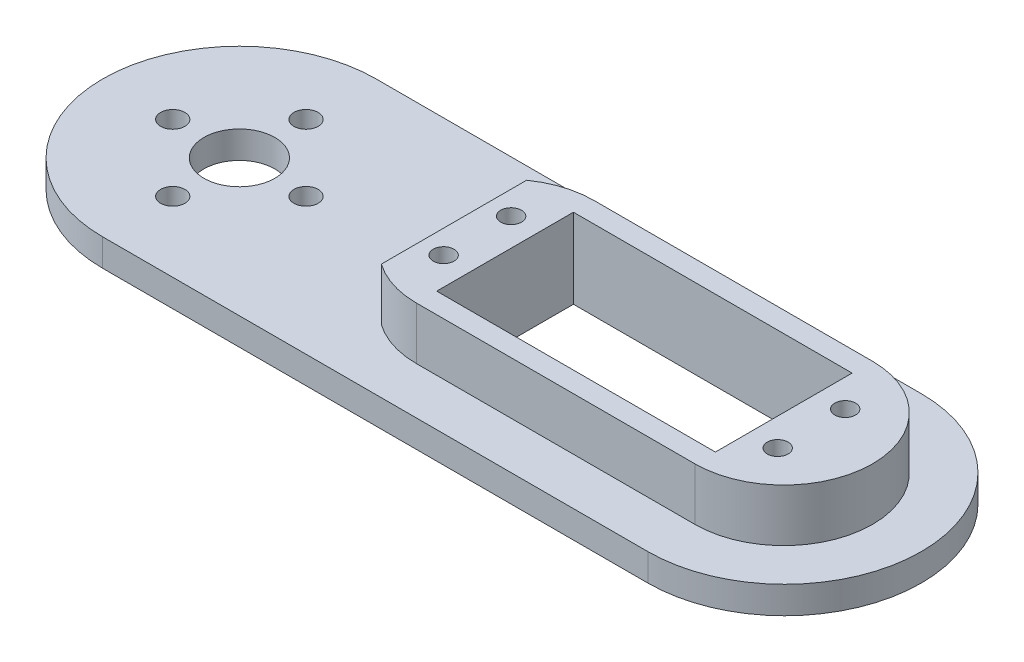
ISO-10303-21;
HEADER;
FILE_DESCRIPTION(('STEP AP214'),'2;1');
FILE_NAME('part.step','',(''),(''),'','','');
FILE_SCHEMA(('AUTOMOTIVE_DESIGN { 1 0 10303 214 1 1 1 1 }'));
ENDSEC;
DATA;
#1=APPLICATION_CONTEXT('core data for automotive mechanical design processes');
#2=APPLICATION_PROTOCOL_DEFINITION('international standard','automotive_design',2000,#1);
#3=PRODUCT_CONTEXT('',#1,'mechanical');
#4=PRODUCT('Part','Part','',(#3));
#5=PRODUCT_RELATED_PRODUCT_CATEGORY('part','',(#4));
#6=PRODUCT_DEFINITION_FORMATION('','',#4);
#7=PRODUCT_DEFINITION_CONTEXT('part definition',#1,'design');
#8=PRODUCT_DEFINITION('design','',#6,#7);
#9=PRODUCT_DEFINITION_SHAPE('','',#8);
#10=(LENGTH_UNIT() NAMED_UNIT(*) SI_UNIT(.MILLI.,.METRE.));
#11=(NAMED_UNIT(*) PLANE_ANGLE_UNIT() SI_UNIT($,.RADIAN.));
#12=(NAMED_UNIT(*) SI_UNIT($,.STERADIAN.) SOLID_ANGLE_UNIT());
#13=UNCERTAINTY_MEASURE_WITH_UNIT(LENGTH_MEASURE(1.E-05),#10,'distance_accuracy_value','');
#14=(GEOMETRIC_REPRESENTATION_CONTEXT(3) GLOBAL_UNCERTAINTY_ASSIGNED_CONTEXT((#13)) GLOBAL_UNIT_ASSIGNED_CONTEXT((#10,
#11,#12)) REPRESENTATION_CONTEXT('',''));
#15=CARTESIAN_POINT('',(0.,0.,0.));
#16=DIRECTION('',(0.,0.,1.));
#17=DIRECTION('',(1.,0.,0.));
#18=AXIS2_PLACEMENT_3D('',#15,#16,#17);
#19=CARTESIAN_POINT('',(39.116,11.1625,0.127));
#20=DIRECTION('',(0.,-1.,0.));
#21=DIRECTION('',(0.,0.,-1.));
#22=AXIS2_PLACEMENT_3D('',#19,#20,#21);
#23=CYLINDRICAL_SURFACE('',#22,13.033);
#24=CARTESIAN_POINT('',(39.116,11.1625,0.127));
#25=DIRECTION('',(0.,1.,0.));
#26=DIRECTION('',(0.,0.,-1.));
#27=AXIS2_PLACEMENT_3D('',#24,#25,#26);
#28=CIRCLE('',#27,13.033);
#29=CARTESIAN_POINT('',(31.616,11.1625,10.7857564471659));
#30=VERTEX_POINT('',#29);
#31=CARTESIAN_POINT('',(39.116,11.1625,13.16));
#32=VERTEX_POINT('',#31);
#33=EDGE_CURVE('E152',#30,#32,#28,.T.);
#34=ORIENTED_EDGE('',*,*,#33,.F.);
#35=DIRECTION('',(0.,-1.,0.));
#36=VECTOR('',#35,1.);
#37=CARTESIAN_POINT('',(31.616,11.1625,10.7857564471659));
#38=LINE('',#37,#36);
#39=CARTESIAN_POINT('',(31.616,3.4625,10.7857564471659));
#40=VERTEX_POINT('',#39);
#41=EDGE_CURVE('E11',#30,#40,#38,.T.);
#42=ORIENTED_EDGE('',*,*,#41,.T.);
#43=CARTESIAN_POINT('',(39.116,3.4625,0.127));
#44=DIRECTION('',(0.,1.,0.));
#45=DIRECTION('',(0.,0.,-1.));
#46=AXIS2_PLACEMENT_3D('',#43,#44,#45);
#47=CIRCLE('',#46,13.033);
#48=CARTESIAN_POINT('',(39.116,3.4625,13.16));
#49=VERTEX_POINT('',#48);
#50=EDGE_CURVE('E181',#40,#49,#47,.T.);
#51=ORIENTED_EDGE('',*,*,#50,.T.);
#52=DIRECTION('',(0.,-1.,0.));
#53=VECTOR('',#52,1.);
#54=CARTESIAN_POINT('',(39.116,11.1625,13.16));
#55=LINE('',#54,#53);
#56=EDGE_CURVE('E159',#32,#49,#55,.T.);
#57=ORIENTED_EDGE('',*,*,#56,.F.);
#58=EDGE_LOOP('',(#34,#42,#51,#57));
#59=FACE_BOUND('',#58,.T.);
#60=ADVANCED_FACE('F43',(#59),#23,.T.);
#61=CARTESIAN_POINT('',(0.,3.4625,0.));
#62=DIRECTION('',(0.,-1.,0.));
#63=DIRECTION('',(0.,0.,-1.));
#64=AXIS2_PLACEMENT_3D('',#61,#62,#63);
#65=PLANE('',#64);
#66=DIRECTION('',(0.,0.,-1.));
#67=VECTOR('',#66,1.);
#68=CARTESIAN_POINT('',(31.616,3.4625,13.16));
#69=LINE('',#68,#67);
#70=CARTESIAN_POINT('',(31.616,3.4625,-10.5317564471659));
#71=VERTEX_POINT('',#70);
#72=EDGE_CURVE('E59',#40,#71,#69,.T.);
#73=ORIENTED_EDGE('',*,*,#72,.T.);
#74=CARTESIAN_POINT('',(39.116,3.4625,-12.906));
#75=VERTEX_POINT('',#74);
#76=EDGE_CURVE('E182',#75,#71,#47,.T.);
#77=ORIENTED_EDGE('',*,*,#76,.F.);
#78=DIRECTION('',(-1.,0.,0.));
#79=VECTOR('',#78,1.);
#80=CARTESIAN_POINT('',(80.01,3.4625,-12.906));
#81=LINE('',#80,#79);
#82=CARTESIAN_POINT('',(80.01,3.4625,-12.906));
#83=VERTEX_POINT('',#82);
#84=EDGE_CURVE('E65',#83,#75,#81,.T.);
#85=ORIENTED_EDGE('',*,*,#84,.F.);
#86=CARTESIAN_POINT('',(80.01,3.4625,0.127));
#87=DIRECTION('',(0.,1.,0.));
#88=DIRECTION('',(0.,0.,1.));
#89=AXIS2_PLACEMENT_3D('',#86,#87,#88);
#90=CIRCLE('',#89,13.033);
#91=CARTESIAN_POINT('',(80.01,3.4625,13.16));
#92=VERTEX_POINT('',#91);
#93=EDGE_CURVE('E174',#92,#83,#90,.T.);
#94=ORIENTED_EDGE('',*,*,#93,.F.);
#95=DIRECTION('',(1.,0.,0.));
#96=VECTOR('',#95,1.);
#97=CARTESIAN_POINT('',(80.01,3.4625,13.16));
#98=LINE('',#97,#96);
#99=EDGE_CURVE('E186',#49,#92,#98,.T.);
#100=ORIENTED_EDGE('',*,*,#99,.F.);
#101=ORIENTED_EDGE('',*,*,#50,.F.);
#102=EDGE_LOOP('',(#73,#77,#85,#94,#100,#101));
#103=FACE_BOUND('',#102,.T.);
#104=CARTESIAN_POINT('',(0.,3.4625,-9.779));
#105=DIRECTION('',(0.,-1.,0.));
#106=DIRECTION('',(0.,0.,-1.));
#107=AXIS2_PLACEMENT_3D('',#104,#105,#106);
#108=CIRCLE('',#107,1.778);
#109=CARTESIAN_POINT('',(0.,3.4625,-11.557));
#110=VERTEX_POINT('',#109);
#111=EDGE_CURVE('E236',#110,#110,#108,.F.);
#112=ORIENTED_EDGE('',*,*,#111,.F.);
#113=EDGE_LOOP('',(#112));
#114=FACE_BOUND('',#113,.T.);
#115=CARTESIAN_POINT('',(0.,3.4625,9.779));
#116=DIRECTION('',(0.,-1.,0.));
#117=DIRECTION('',(0.,0.,-1.));
#118=AXIS2_PLACEMENT_3D('',#115,#116,#117);
#119=CIRCLE('',#118,1.778);
#120=CARTESIAN_POINT('',(0.,3.4625,8.001));
#121=VERTEX_POINT('',#120);
#122=EDGE_CURVE('E228',#121,#121,#119,.F.);
#123=ORIENTED_EDGE('',*,*,#122,.F.);
#124=EDGE_LOOP('',(#123));
#125=FACE_BOUND('',#124,.T.);
#126=CARTESIAN_POINT('',(0.,3.4625,0.));
#127=DIRECTION('',(0.,-1.,0.));
#128=DIRECTION('',(0.,0.,-1.));
#129=AXIS2_PLACEMENT_3D('',#126,#127,#128);
#130=CIRCLE('',#129,20.066);
#131=CARTESIAN_POINT('',(0.,3.4625,-20.066));
#132=VERTEX_POINT('',#131);
#133=CARTESIAN_POINT('',(0.,3.4625,20.066));
#134=VERTEX_POINT('',#133);
#135=EDGE_CURVE('E221',#132,#134,#130,.F.);
#136=ORIENTED_EDGE('',*,*,#135,.T.);
#137=DIRECTION('',(1.,0.,0.));
#138=VECTOR('',#137,1.);
#139=CARTESIAN_POINT('',(0.,3.4625,20.066));
#140=LINE('',#139,#138);
#141=CARTESIAN_POINT('',(80.01,3.4625,20.066));
#142=VERTEX_POINT('',#141);
#143=EDGE_CURVE('E210',#134,#142,#140,.T.);
#144=ORIENTED_EDGE('',*,*,#143,.T.);
#145=CARTESIAN_POINT('',(80.01,3.4625,0.));
#146=DIRECTION('',(0.,-1.,0.));
#147=DIRECTION('',(0.,0.,-1.));
#148=AXIS2_PLACEMENT_3D('',#145,#146,#147);
#149=CIRCLE('',#148,20.066);
#150=CARTESIAN_POINT('',(80.01,3.4625,-20.066));
#151=VERTEX_POINT('',#150);
#152=EDGE_CURVE('E213',#151,#142,#149,.T.);
#153=ORIENTED_EDGE('',*,*,#152,.F.);
#154=DIRECTION('',(1.,0.,0.));
#155=VECTOR('',#154,1.);
#156=CARTESIAN_POINT('',(0.,3.4625,-20.066));
#157=LINE('',#156,#155);
#158=EDGE_CURVE('E217',#132,#151,#157,.T.);
#159=ORIENTED_EDGE('',*,*,#158,.F.);
#160=EDGE_LOOP('',(#136,#144,#153,#159));
#161=FACE_BOUND('',#160,.T.);
#162=CARTESIAN_POINT('',(9.779,3.4625,0.));
#163=DIRECTION('',(0.,-1.,0.));
#164=DIRECTION('',(0.,0.,-1.));
#165=AXIS2_PLACEMENT_3D('',#162,#163,#164);
#166=CIRCLE('',#165,1.778);
#167=CARTESIAN_POINT('',(9.779,3.4625,-1.77799999999997));
#168=VERTEX_POINT('',#167);
#169=EDGE_CURVE('E224',#168,#168,#166,.F.);
#170=ORIENTED_EDGE('',*,*,#169,.F.);
#171=EDGE_LOOP('',(#170));
#172=FACE_BOUND('',#171,.T.);
#173=CARTESIAN_POINT('',(-9.779,3.4625,-1.02429588037641E-13));
#174=DIRECTION('',(0.,-1.,0.));
#175=DIRECTION('',(0.,0.,-1.));
#176=AXIS2_PLACEMENT_3D('',#173,#174,#175);
#177=CIRCLE('',#176,1.778);
#178=CARTESIAN_POINT('',(-9.779,3.4625,-1.7780000000001));
#179=VERTEX_POINT('',#178);
#180=EDGE_CURVE('E232',#179,#179,#177,.F.);
#181=ORIENTED_EDGE('',*,*,#180,.F.);
#182=EDGE_LOOP('',(#181));
#183=FACE_BOUND('',#182,.T.);
#184=CARTESIAN_POINT('',(0.,3.4625,0.));
#185=DIRECTION('',(0.,-1.,0.));
#186=DIRECTION('',(0.,0.,-1.));
#187=AXIS2_PLACEMENT_3D('',#184,#185,#186);
#188=CIRCLE('',#187,5.2);
#189=CARTESIAN_POINT('',(0.,3.4625,-5.2));
#190=VERTEX_POINT('',#189);
#191=EDGE_CURVE('E202',#190,#190,#188,.T.);
#192=ORIENTED_EDGE('',*,*,#191,.T.);
#193=EDGE_LOOP('',(#192));
#194=FACE_BOUND('',#193,.T.);
#195=ADVANCED_FACE('F332',(#103,#114,#125,#161,#172,#183,#194),#65,.F.);
#196=CARTESIAN_POINT('',(0.,-0.54,0.));
#197=DIRECTION('',(0.,1.,0.));
#198=DIRECTION('',(0.,0.,1.));
#199=AXIS2_PLACEMENT_3D('',#196,#197,#198);
#200=CYLINDRICAL_SURFACE('',#199,20.066);
#201=ORIENTED_EDGE('',*,*,#135,.F.);
#202=DIRECTION('',(0.,1.,0.));
#203=VECTOR('',#202,1.);
#204=CARTESIAN_POINT('',(0.,-0.54,-20.066));
#205=LINE('',#204,#203);
#206=CARTESIAN_POINT('',(0.,-0.54,-20.066));
#207=VERTEX_POINT('',#206);
#208=EDGE_CURVE('E306',#207,#132,#205,.T.);
#209=ORIENTED_EDGE('',*,*,#208,.F.);
#210=CARTESIAN_POINT('',(0.,-0.54,0.));
#211=DIRECTION('',(0.,1.,0.));
#212=DIRECTION('',(0.,0.,1.));
#213=AXIS2_PLACEMENT_3D('',#210,#211,#212);
#214=CIRCLE('',#213,20.066);
#215=CARTESIAN_POINT('',(0.,-0.54,20.066));
#216=VERTEX_POINT('',#215);
#217=EDGE_CURVE('E326',#207,#216,#214,.T.);
#218=ORIENTED_EDGE('',*,*,#217,.T.);
#219=DIRECTION('',(0.,1.,0.));
#220=VECTOR('',#219,1.);
#221=CARTESIAN_POINT('',(0.,-0.54,20.066));
#222=LINE('',#221,#220);
#223=EDGE_CURVE('E294',#216,#134,#222,.T.);
#224=ORIENTED_EDGE('',*,*,#223,.T.);
#225=EDGE_LOOP('',(#201,#209,#218,#224));
#226=FACE_BOUND('',#225,.T.);
#227=ADVANCED_FACE('F45',(#226),#200,.T.);
#228=CARTESIAN_POINT('',(0.,-0.54,0.));
#229=DIRECTION('',(0.,1.,0.));
#230=DIRECTION('',(0.,0.,1.));
#231=AXIS2_PLACEMENT_3D('',#228,#229,#230);
#232=PLANE('',#231);
#233=CARTESIAN_POINT('',(0.,-0.54,0.));
#234=DIRECTION('',(0.,1.,0.));
#235=DIRECTION('',(0.,0.,1.));
#236=AXIS2_PLACEMENT_3D('',#233,#234,#235);
#237=CIRCLE('',#236,5.2);
#238=CARTESIAN_POINT('',(0.,-0.54,5.2));
#239=VERTEX_POINT('',#238);
#240=EDGE_CURVE('E206',#239,#239,#237,.T.);
#241=ORIENTED_EDGE('',*,*,#240,.T.);
#242=EDGE_LOOP('',(#241));
#243=FACE_BOUND('',#242,.T.);
#244=CARTESIAN_POINT('',(35.052,-0.54,-4.826));
#245=DIRECTION('',(0.,-1.,0.));
#246=DIRECTION('',(0.,0.,-1.));
#247=AXIS2_PLACEMENT_3D('',#244,#245,#246);
#248=CIRCLE('',#247,1.524);
#249=CARTESIAN_POINT('',(35.052,-0.54,-6.35));
#250=VERTEX_POINT('',#249);
#251=EDGE_CURVE('E245',#250,#250,#248,.T.);
#252=ORIENTED_EDGE('',*,*,#251,.F.);
#253=EDGE_LOOP('',(#252));
#254=FACE_BOUND('',#253,.T.);
#255=CARTESIAN_POINT('',(84.074,-0.54,5.08));
#256=DIRECTION('',(0.,-1.,0.));
#257=DIRECTION('',(0.,0.,-1.));
#258=AXIS2_PLACEMENT_3D('',#255,#256,#257);
#259=CIRCLE('',#258,1.52399999999999);
#260=CARTESIAN_POINT('',(84.074,-0.54,3.55600000000001));
#261=VERTEX_POINT('',#260);
#262=EDGE_CURVE('E244',#261,#261,#259,.T.);
#263=ORIENTED_EDGE('',*,*,#262,.F.);
#264=EDGE_LOOP('',(#263));
#265=FACE_BOUND('',#264,.T.);
#266=CARTESIAN_POINT('',(84.074,-0.54,-4.826));
#267=DIRECTION('',(0.,-1.,0.));
#268=DIRECTION('',(0.,0.,-1.));
#269=AXIS2_PLACEMENT_3D('',#266,#267,#268);
#270=CIRCLE('',#269,1.52399999999999);
#271=CARTESIAN_POINT('',(84.074,-0.54,-6.34999999999999));
#272=VERTEX_POINT('',#271);
#273=EDGE_CURVE('E240',#272,#272,#270,.T.);
#274=ORIENTED_EDGE('',*,*,#273,.F.);
#275=EDGE_LOOP('',(#274));
#276=FACE_BOUND('',#275,.T.);
#277=CARTESIAN_POINT('',(35.052,-0.54,5.08));
#278=DIRECTION('',(0.,-1.,0.));
#279=DIRECTION('',(0.,0.,-1.));
#280=AXIS2_PLACEMENT_3D('',#277,#278,#279);
#281=CIRCLE('',#280,1.524);
#282=CARTESIAN_POINT('',(35.052,-0.54,3.556));
#283=VERTEX_POINT('',#282);
#284=EDGE_CURVE('E249',#283,#283,#281,.T.);
#285=ORIENTED_EDGE('',*,*,#284,.F.);
#286=EDGE_LOOP('',(#285));
#287=FACE_BOUND('',#286,.T.);
#288=DIRECTION('',(-1.,0.,0.));
#289=VECTOR('',#288,1.);
#290=CARTESIAN_POINT('',(80.01,-0.54,10.16));
#291=LINE('',#290,#289);
#292=CARTESIAN_POINT('',(80.01,-0.54,10.16));
#293=VERTEX_POINT('',#292);
#294=CARTESIAN_POINT('',(39.116,-0.54,10.16));
#295=VERTEX_POINT('',#294);
#296=EDGE_CURVE('E260',#293,#295,#291,.T.);
#297=ORIENTED_EDGE('',*,*,#296,.F.);
#298=DIRECTION('',(0.,0.,1.));
#299=VECTOR('',#298,1.);
#300=CARTESIAN_POINT('',(80.01,-0.54,-9.906));
#301=LINE('',#300,#299);
#302=CARTESIAN_POINT('',(80.01,-0.54,-9.906));
#303=VERTEX_POINT('',#302);
#304=EDGE_CURVE('E256',#303,#293,#301,.T.);
#305=ORIENTED_EDGE('',*,*,#304,.F.);
#306=DIRECTION('',(1.,0.,0.));
#307=VECTOR('',#306,1.);
#308=CARTESIAN_POINT('',(39.116,-0.54,-9.906));
#309=LINE('',#308,#307);
#310=CARTESIAN_POINT('',(39.116,-0.54,-9.906));
#311=VERTEX_POINT('',#310);
#312=EDGE_CURVE('E268',#311,#303,#309,.T.);
#313=ORIENTED_EDGE('',*,*,#312,.F.);
#314=DIRECTION('',(0.,0.,-1.));
#315=VECTOR('',#314,1.);
#316=CARTESIAN_POINT('',(39.116,-0.54,10.16));
#317=LINE('',#316,#315);
#318=EDGE_CURVE('E264',#295,#311,#317,.T.);
#319=ORIENTED_EDGE('',*,*,#318,.F.);
#320=EDGE_LOOP('',(#297,#305,#313,#319));
#321=FACE_BOUND('',#320,.T.);
#322=CARTESIAN_POINT('',(9.779,-0.54,0.));
#323=DIRECTION('',(0.,1.,0.));
#324=DIRECTION('',(-1.,0.,0.));
#325=AXIS2_PLACEMENT_3D('',#322,#323,#324);
#326=CIRCLE('',#325,1.778);
#327=CARTESIAN_POINT('',(8.001,-0.54,0.));
#328=VERTEX_POINT('',#327);
#329=EDGE_CURVE('E311',#328,#328,#326,.T.);
#330=ORIENTED_EDGE('',*,*,#329,.T.);
#331=EDGE_LOOP('',(#330));
#332=FACE_BOUND('',#331,.T.);
#333=CARTESIAN_POINT('',(0.,-0.54,9.779));
#334=DIRECTION('',(0.,1.,0.));
#335=DIRECTION('',(0.,0.,-1.));
#336=AXIS2_PLACEMENT_3D('',#333,#334,#335);
#337=CIRCLE('',#336,1.778);
#338=CARTESIAN_POINT('',(0.,-0.54,8.001));
#339=VERTEX_POINT('',#338);
#340=EDGE_CURVE('E316',#339,#339,#337,.T.);
#341=ORIENTED_EDGE('',*,*,#340,.T.);
#342=EDGE_LOOP('',(#341));
#343=FACE_BOUND('',#342,.T.);
#344=CARTESIAN_POINT('',(-9.779,-0.54,-1.02429588037641E-13));
#345=DIRECTION('',(0.,1.,0.));
#346=DIRECTION('',(1.,0.,0.));
#347=AXIS2_PLACEMENT_3D('',#344,#345,#346);
#348=CIRCLE('',#347,1.778);
#349=CARTESIAN_POINT('',(-8.001,-0.54,0.));
#350=VERTEX_POINT('',#349);
#351=EDGE_CURVE('E310',#350,#350,#348,.T.);
#352=ORIENTED_EDGE('',*,*,#351,.T.);
#353=EDGE_LOOP('',(#352));
#354=FACE_BOUND('',#353,.T.);
#355=CARTESIAN_POINT('',(0.,-0.54,-9.779));
#356=DIRECTION('',(0.,1.,0.));
#357=DIRECTION('',(0.,0.,1.));
#358=AXIS2_PLACEMENT_3D('',#355,#356,#357);
#359=CIRCLE('',#358,1.778);
#360=CARTESIAN_POINT('',(0.,-0.54,-8.001));
#361=VERTEX_POINT('',#360);
#362=EDGE_CURVE('E315',#361,#361,#359,.T.);
#363=ORIENTED_EDGE('',*,*,#362,.T.);
#364=EDGE_LOOP('',(#363));
#365=FACE_BOUND('',#364,.T.);
#366=ORIENTED_EDGE('',*,*,#217,.F.);
#367=DIRECTION('',(1.,0.,0.));
#368=VECTOR('',#367,1.);
#369=CARTESIAN_POINT('',(0.,-0.54,-20.066));
#370=LINE('',#369,#368);
#371=CARTESIAN_POINT('',(80.01,-0.54,-20.066));
#372=VERTEX_POINT('',#371);
#373=EDGE_CURVE('E276',#207,#372,#370,.T.);
#374=ORIENTED_EDGE('',*,*,#373,.T.);
#375=CARTESIAN_POINT('',(80.01,-0.54,0.));
#376=DIRECTION('',(0.,-1.,0.));
#377=DIRECTION('',(0.,0.,-1.));
#378=AXIS2_PLACEMENT_3D('',#375,#376,#377);
#379=CIRCLE('',#378,20.066);
#380=CARTESIAN_POINT('',(80.01,-0.54,20.066));
#381=VERTEX_POINT('',#380);
#382=EDGE_CURVE('E287',#372,#381,#379,.T.);
#383=ORIENTED_EDGE('',*,*,#382,.T.);
#384=DIRECTION('',(1.,0.,0.));
#385=VECTOR('',#384,1.);
#386=CARTESIAN_POINT('',(0.,-0.54,20.066));
#387=LINE('',#386,#385);
#388=EDGE_CURVE('E290',#216,#381,#387,.T.);
#389=ORIENTED_EDGE('',*,*,#388,.F.);
#390=EDGE_LOOP('',(#366,#374,#383,#389));
#391=FACE_BOUND('',#390,.T.);
#392=ADVANCED_FACE('F468',(#243,#254,#265,#276,#287,#321,#332,#343,#354,#365,#391),#232,.F.);
#393=CARTESIAN_POINT('',(0.,-0.54,-9.779));
#394=DIRECTION('',(0.,1.,0.));
#395=DIRECTION('',(0.,0.,1.));
#396=AXIS2_PLACEMENT_3D('',#393,#394,#395);
#397=CYLINDRICAL_SURFACE('',#396,1.778);
#398=ORIENTED_EDGE('',*,*,#111,.T.);
#399=EDGE_LOOP('',(#398));
#400=FACE_BOUND('',#399,.T.);
#401=ORIENTED_EDGE('',*,*,#362,.F.);
#402=EDGE_LOOP('',(#401));
#403=FACE_BOUND('',#402,.T.);
#404=ADVANCED_FACE('F465',(#400,#403),#397,.F.);
#405=CARTESIAN_POINT('',(-9.779,-0.54,-1.02429588037641E-13));
#406=DIRECTION('',(0.,1.,0.));
#407=DIRECTION('',(0.,0.,1.));
#408=AXIS2_PLACEMENT_3D('',#405,#406,#407);
#409=CYLINDRICAL_SURFACE('',#408,1.778);
#410=ORIENTED_EDGE('',*,*,#180,.T.);
#411=EDGE_LOOP('',(#410));
#412=FACE_BOUND('',#411,.T.);
#413=ORIENTED_EDGE('',*,*,#351,.F.);
#414=EDGE_LOOP('',(#413));
#415=FACE_BOUND('',#414,.T.);
#416=ADVANCED_FACE('F461',(#412,#415),#409,.F.);
#417=CARTESIAN_POINT('',(0.,-0.54,9.779));
#418=DIRECTION('',(0.,1.,0.));
#419=DIRECTION('',(0.,0.,1.));
#420=AXIS2_PLACEMENT_3D('',#417,#418,#419);
#421=CYLINDRICAL_SURFACE('',#420,1.778);
#422=ORIENTED_EDGE('',*,*,#122,.T.);
#423=EDGE_LOOP('',(#422));
#424=FACE_BOUND('',#423,.T.);
#425=ORIENTED_EDGE('',*,*,#340,.F.);
#426=EDGE_LOOP('',(#425));
#427=FACE_BOUND('',#426,.T.);
#428=ADVANCED_FACE('F457',(#424,#427),#421,.F.);
#429=CARTESIAN_POINT('',(9.779,-0.54,0.));
#430=DIRECTION('',(0.,1.,0.));
#431=DIRECTION('',(0.,0.,1.));
#432=AXIS2_PLACEMENT_3D('',#429,#430,#431);
#433=CYLINDRICAL_SURFACE('',#432,1.778);
#434=ORIENTED_EDGE('',*,*,#169,.T.);
#435=EDGE_LOOP('',(#434));
#436=FACE_BOUND('',#435,.T.);
#437=ORIENTED_EDGE('',*,*,#329,.F.);
#438=EDGE_LOOP('',(#437));
#439=FACE_BOUND('',#438,.T.);
#440=ADVANCED_FACE('F453',(#436,#439),#433,.F.);
#441=CARTESIAN_POINT('',(0.,-0.54,-20.066));
#442=DIRECTION('',(0.,0.,1.));
#443=DIRECTION('',(1.,0.,0.));
#444=AXIS2_PLACEMENT_3D('',#441,#442,#443);
#445=PLANE('',#444);
#446=ORIENTED_EDGE('',*,*,#208,.T.);
#447=ORIENTED_EDGE('',*,*,#158,.T.);
#448=DIRECTION('',(0.,1.,0.));
#449=VECTOR('',#448,1.);
#450=CARTESIAN_POINT('',(80.01,-0.54,-20.066));
#451=LINE('',#450,#449);
#452=EDGE_CURVE('E302',#372,#151,#451,.T.);
#453=ORIENTED_EDGE('',*,*,#452,.F.);
#454=ORIENTED_EDGE('',*,*,#373,.F.);
#455=EDGE_LOOP('',(#446,#447,#453,#454));
#456=FACE_BOUND('',#455,.T.);
#457=ADVANCED_FACE('F449',(#456),#445,.F.);
#458=CARTESIAN_POINT('',(80.01,-0.54,0.));
#459=DIRECTION('',(0.,1.,0.));
#460=DIRECTION('',(0.,0.,1.));
#461=AXIS2_PLACEMENT_3D('',#458,#459,#460);
#462=CYLINDRICAL_SURFACE('',#461,20.066);
#463=ORIENTED_EDGE('',*,*,#452,.T.);
#464=ORIENTED_EDGE('',*,*,#152,.T.);
#465=DIRECTION('',(0.,1.,0.));
#466=VECTOR('',#465,1.);
#467=CARTESIAN_POINT('',(80.01,-0.54,20.066));
#468=LINE('',#467,#466);
#469=EDGE_CURVE('E298',#381,#142,#468,.T.);
#470=ORIENTED_EDGE('',*,*,#469,.F.);
#471=ORIENTED_EDGE('',*,*,#382,.F.);
#472=EDGE_LOOP('',(#463,#464,#470,#471));
#473=FACE_BOUND('',#472,.T.);
#474=ADVANCED_FACE('F445',(#473),#462,.T.);
#475=CARTESIAN_POINT('',(0.,-0.54,20.066));
#476=DIRECTION('',(0.,0.,1.));
#477=DIRECTION('',(1.,0.,0.));
#478=AXIS2_PLACEMENT_3D('',#475,#476,#477);
#479=PLANE('',#478);
#480=ORIENTED_EDGE('',*,*,#143,.F.);
#481=ORIENTED_EDGE('',*,*,#223,.F.);
#482=ORIENTED_EDGE('',*,*,#388,.T.);
#483=ORIENTED_EDGE('',*,*,#469,.T.);
#484=EDGE_LOOP('',(#480,#481,#482,#483));
#485=FACE_BOUND('',#484,.T.);
#486=ADVANCED_FACE('F441',(#485),#479,.T.);
#487=CARTESIAN_POINT('',(80.01,4.2235,-9.906));
#488=DIRECTION('',(1.,0.,0.));
#489=DIRECTION('',(0.,0.,-1.));
#490=AXIS2_PLACEMENT_3D('',#487,#488,#489);
#491=PLANE('',#490);
#492=DIRECTION('',(0.,-1.,0.));
#493=VECTOR('',#492,1.);
#494=CARTESIAN_POINT('',(80.01,4.2235,10.16));
#495=LINE('',#494,#493);
#496=CARTESIAN_POINT('',(80.01,11.1625,10.16));
#497=VERTEX_POINT('',#496);
#498=EDGE_CURVE('E272',#497,#293,#495,.T.);
#499=ORIENTED_EDGE('',*,*,#498,.F.);
#500=DIRECTION('',(0.,0.,-1.));
#501=VECTOR('',#500,1.);
#502=CARTESIAN_POINT('',(80.01,11.1625,10.16));
#503=LINE('',#502,#501);
#504=CARTESIAN_POINT('',(80.01,11.1625,-9.906));
#505=VERTEX_POINT('',#504);
#506=EDGE_CURVE('E350',#497,#505,#503,.T.);
#507=ORIENTED_EDGE('',*,*,#506,.T.);
#508=DIRECTION('',(0.,-1.,0.));
#509=VECTOR('',#508,1.);
#510=CARTESIAN_POINT('',(80.01,4.2235,-9.906));
#511=LINE('',#510,#509);
#512=EDGE_CURVE('E273',#505,#303,#511,.T.);
#513=ORIENTED_EDGE('',*,*,#512,.T.);
#514=ORIENTED_EDGE('',*,*,#304,.T.);
#515=EDGE_LOOP('',(#499,#507,#513,#514));
#516=FACE_BOUND('',#515,.T.);
#517=ADVANCED_FACE('F431',(#516),#491,.F.);
#518=CARTESIAN_POINT('',(39.116,4.2235,-9.906));
#519=DIRECTION('',(0.,0.,-1.));
#520=DIRECTION('',(-1.,0.,0.));
#521=AXIS2_PLACEMENT_3D('',#518,#519,#520);
#522=PLANE('',#521);
#523=ORIENTED_EDGE('',*,*,#512,.F.);
#524=DIRECTION('',(-1.,0.,0.));
#525=VECTOR('',#524,1.);
#526=CARTESIAN_POINT('',(39.116,11.1625,-9.906));
#527=LINE('',#526,#525);
#528=CARTESIAN_POINT('',(39.116,11.1625,-9.906));
#529=VERTEX_POINT('',#528);
#530=EDGE_CURVE('E178',#505,#529,#527,.T.);
#531=ORIENTED_EDGE('',*,*,#530,.T.);
#532=DIRECTION('',(0.,-1.,0.));
#533=VECTOR('',#532,1.);
#534=CARTESIAN_POINT('',(39.116,4.2235,-9.906));
#535=LINE('',#534,#533);
#536=EDGE_CURVE('E277',#529,#311,#535,.T.);
#537=ORIENTED_EDGE('',*,*,#536,.T.);
#538=ORIENTED_EDGE('',*,*,#312,.T.);
#539=EDGE_LOOP('',(#523,#531,#537,#538));
#540=FACE_BOUND('',#539,.T.);
#541=ADVANCED_FACE('F427',(#540),#522,.F.);
#542=CARTESIAN_POINT('',(39.116,4.2235,10.16));
#543=DIRECTION('',(-1.,0.,0.));
#544=DIRECTION('',(0.,0.,1.));
#545=AXIS2_PLACEMENT_3D('',#542,#543,#544);
#546=PLANE('',#545);
#547=ORIENTED_EDGE('',*,*,#536,.F.);
#548=DIRECTION('',(0.,0.,1.));
#549=VECTOR('',#548,1.);
#550=CARTESIAN_POINT('',(39.116,11.1625,10.16));
#551=LINE('',#550,#549);
#552=CARTESIAN_POINT('',(39.116,11.1625,10.16));
#553=VERTEX_POINT('',#552);
#554=EDGE_CURVE('E358',#529,#553,#551,.T.);
#555=ORIENTED_EDGE('',*,*,#554,.T.);
#556=DIRECTION('',(0.,-1.,0.));
#557=VECTOR('',#556,1.);
#558=CARTESIAN_POINT('',(39.116,4.2235,10.16));
#559=LINE('',#558,#557);
#560=EDGE_CURVE('E280',#553,#295,#559,.T.);
#561=ORIENTED_EDGE('',*,*,#560,.T.);
#562=ORIENTED_EDGE('',*,*,#318,.T.);
#563=EDGE_LOOP('',(#547,#555,#561,#562));
#564=FACE_BOUND('',#563,.T.);
#565=ADVANCED_FACE('F430',(#564),#546,.F.);
#566=CARTESIAN_POINT('',(80.01,4.2235,10.16));
#567=DIRECTION('',(0.,0.,1.));
#568=DIRECTION('',(1.,0.,0.));
#569=AXIS2_PLACEMENT_3D('',#566,#567,#568);
#570=PLANE('',#569);
#571=ORIENTED_EDGE('',*,*,#560,.F.);
#572=DIRECTION('',(1.,0.,0.));
#573=VECTOR('',#572,1.);
#574=CARTESIAN_POINT('',(39.116,11.1625,10.16));
#575=LINE('',#574,#573);
#576=EDGE_CURVE('E354',#553,#497,#575,.T.);
#577=ORIENTED_EDGE('',*,*,#576,.T.);
#578=ORIENTED_EDGE('',*,*,#498,.T.);
#579=ORIENTED_EDGE('',*,*,#296,.T.);
#580=EDGE_LOOP('',(#571,#577,#578,#579));
#581=FACE_BOUND('',#580,.T.);
#582=ADVANCED_FACE('F425',(#581),#570,.F.);
#583=CARTESIAN_POINT('',(35.052,4.2225,5.08));
#584=DIRECTION('',(0.,-1.,0.));
#585=DIRECTION('',(0.,0.,-1.));
#586=AXIS2_PLACEMENT_3D('',#583,#584,#585);
#587=CYLINDRICAL_SURFACE('',#586,1.524);
#588=ORIENTED_EDGE('',*,*,#284,.T.);
#589=EDGE_LOOP('',(#588));
#590=FACE_BOUND('',#589,.T.);
#591=CARTESIAN_POINT('',(35.052,11.1625,5.08));
#592=DIRECTION('',(0.,1.,0.));
#593=DIRECTION('',(0.,0.,1.));
#594=AXIS2_PLACEMENT_3D('',#591,#592,#593);
#595=CIRCLE('',#594,1.524);
#596=CARTESIAN_POINT('',(35.052,11.1625,6.604));
#597=VERTEX_POINT('',#596);
#598=EDGE_CURVE('E370',#597,#597,#595,.T.);
#599=ORIENTED_EDGE('',*,*,#598,.T.);
#600=EDGE_LOOP('',(#599));
#601=FACE_BOUND('',#600,.T.);
#602=ADVANCED_FACE('F415',(#590,#601),#587,.F.);
#603=CARTESIAN_POINT('',(84.074,4.2225,-4.826));
#604=DIRECTION('',(0.,-1.,0.));
#605=DIRECTION('',(0.,0.,-1.));
#606=AXIS2_PLACEMENT_3D('',#603,#604,#605);
#607=CYLINDRICAL_SURFACE('',#606,1.52399999999999);
#608=ORIENTED_EDGE('',*,*,#273,.T.);
#609=EDGE_LOOP('',(#608));
#610=FACE_BOUND('',#609,.T.);
#611=CARTESIAN_POINT('',(84.074,11.1625,-4.826));
#612=DIRECTION('',(0.,1.,0.));
#613=DIRECTION('',(0.,0.,1.));
#614=AXIS2_PLACEMENT_3D('',#611,#612,#613);
#615=CIRCLE('',#614,1.52399999999999);
#616=CARTESIAN_POINT('',(84.074,11.1625,-3.30200000000001));
#617=VERTEX_POINT('',#616);
#618=EDGE_CURVE('E366',#617,#617,#615,.T.);
#619=ORIENTED_EDGE('',*,*,#618,.T.);
#620=EDGE_LOOP('',(#619));
#621=FACE_BOUND('',#620,.T.);
#622=ADVANCED_FACE('F411',(#610,#621),#607,.F.);
#623=CARTESIAN_POINT('',(84.074,4.2225,5.08));
#624=DIRECTION('',(0.,-1.,0.));
#625=DIRECTION('',(0.,0.,-1.));
#626=AXIS2_PLACEMENT_3D('',#623,#624,#625);
#627=CYLINDRICAL_SURFACE('',#626,1.52399999999999);
#628=ORIENTED_EDGE('',*,*,#262,.T.);
#629=EDGE_LOOP('',(#628));
#630=FACE_BOUND('',#629,.T.);
#631=CARTESIAN_POINT('',(84.074,11.1625,5.08));
#632=DIRECTION('',(0.,1.,0.));
#633=DIRECTION('',(0.,0.,1.));
#634=AXIS2_PLACEMENT_3D('',#631,#632,#633);
#635=CIRCLE('',#634,1.52399999999999);
#636=CARTESIAN_POINT('',(84.074,11.1625,6.60399999999999));
#637=VERTEX_POINT('',#636);
#638=EDGE_CURVE('E362',#637,#637,#635,.T.);
#639=ORIENTED_EDGE('',*,*,#638,.T.);
#640=EDGE_LOOP('',(#639));
#641=FACE_BOUND('',#640,.T.);
#642=ADVANCED_FACE('F414',(#630,#641),#627,.F.);
#643=CARTESIAN_POINT('',(35.052,4.2225,-4.826));
#644=DIRECTION('',(0.,-1.,0.));
#645=DIRECTION('',(0.,0.,-1.));
#646=AXIS2_PLACEMENT_3D('',#643,#644,#645);
#647=CYLINDRICAL_SURFACE('',#646,1.524);
#648=ORIENTED_EDGE('',*,*,#251,.T.);
#649=EDGE_LOOP('',(#648));
#650=FACE_BOUND('',#649,.T.);
#651=CARTESIAN_POINT('',(35.052,11.1625,-4.826));
#652=DIRECTION('',(0.,1.,0.));
#653=DIRECTION('',(0.,0.,1.));
#654=AXIS2_PLACEMENT_3D('',#651,#652,#653);
#655=CIRCLE('',#654,1.524);
#656=CARTESIAN_POINT('',(35.052,11.1625,-3.302));
#657=VERTEX_POINT('',#656);
#658=EDGE_CURVE('E374',#657,#657,#655,.T.);
#659=ORIENTED_EDGE('',*,*,#658,.T.);
#660=EDGE_LOOP('',(#659));
#661=FACE_BOUND('',#660,.T.);
#662=ADVANCED_FACE('F382',(#650,#661),#647,.F.);
#663=CARTESIAN_POINT('',(0.,3.4625,0.));
#664=DIRECTION('',(0.,-1.,0.));
#665=DIRECTION('',(0.,0.,-1.));
#666=AXIS2_PLACEMENT_3D('',#663,#664,#665);
#667=CYLINDRICAL_SURFACE('',#666,5.2);
#668=ORIENTED_EDGE('',*,*,#191,.F.);
#669=EDGE_LOOP('',(#668));
#670=FACE_BOUND('',#669,.T.);
#671=ORIENTED_EDGE('',*,*,#240,.F.);
#672=EDGE_LOOP('',(#671));
#673=FACE_BOUND('',#672,.T.);
#674=ADVANCED_FACE('F385',(#670,#673),#667,.F.);
#675=CARTESIAN_POINT('',(80.01,11.1625,0.127));
#676=DIRECTION('',(0.,1.,0.));
#677=DIRECTION('',(0.,0.,1.));
#678=AXIS2_PLACEMENT_3D('',#675,#676,#677);
#679=PLANE('',#678);
#680=DIRECTION('',(0.,0.,-1.));
#681=VECTOR('',#680,1.);
#682=CARTESIAN_POINT('',(31.616,11.1625,13.16));
#683=LINE('',#682,#681);
#684=CARTESIAN_POINT('',(31.616,11.1625,-10.5317564471659));
#685=VERTEX_POINT('',#684);
#686=EDGE_CURVE('E144',#30,#685,#683,.T.);
#687=ORIENTED_EDGE('',*,*,#686,.F.);
#688=ORIENTED_EDGE('',*,*,#33,.T.);
#689=DIRECTION('',(1.,0.,0.));
#690=VECTOR('',#689,1.);
#691=CARTESIAN_POINT('',(80.01,11.1625,13.16));
#692=LINE('',#691,#690);
#693=CARTESIAN_POINT('',(80.01,11.1625,13.16));
#694=VERTEX_POINT('',#693);
#695=EDGE_CURVE('E166',#32,#694,#692,.T.);
#696=ORIENTED_EDGE('',*,*,#695,.T.);
#697=CARTESIAN_POINT('',(80.01,11.1625,0.127));
#698=DIRECTION('',(0.,1.,0.));
#699=DIRECTION('',(0.,0.,1.));
#700=AXIS2_PLACEMENT_3D('',#697,#698,#699);
#701=CIRCLE('',#700,13.033);
#702=CARTESIAN_POINT('',(80.01,11.1625,-12.906));
#703=VERTEX_POINT('',#702);
#704=EDGE_CURVE('E167',#694,#703,#701,.T.);
#705=ORIENTED_EDGE('',*,*,#704,.T.);
#706=DIRECTION('',(-1.,0.,0.));
#707=VECTOR('',#706,1.);
#708=CARTESIAN_POINT('',(80.01,11.1625,-12.906));
#709=LINE('',#708,#707);
#710=CARTESIAN_POINT('',(39.116,11.1625,-12.906));
#711=VERTEX_POINT('',#710);
#712=EDGE_CURVE('E162',#703,#711,#709,.T.);
#713=ORIENTED_EDGE('',*,*,#712,.T.);
#714=EDGE_CURVE('E155',#711,#685,#28,.T.);
#715=ORIENTED_EDGE('',*,*,#714,.T.);
#716=EDGE_LOOP('',(#687,#688,#696,#705,#713,#715));
#717=FACE_BOUND('',#716,.T.);
#718=ORIENTED_EDGE('',*,*,#598,.F.);
#719=EDGE_LOOP('',(#718));
#720=FACE_BOUND('',#719,.T.);
#721=ORIENTED_EDGE('',*,*,#638,.F.);
#722=EDGE_LOOP('',(#721));
#723=FACE_BOUND('',#722,.T.);
#724=ORIENTED_EDGE('',*,*,#576,.F.);
#725=ORIENTED_EDGE('',*,*,#554,.F.);
#726=ORIENTED_EDGE('',*,*,#530,.F.);
#727=ORIENTED_EDGE('',*,*,#506,.F.);
#728=EDGE_LOOP('',(#724,#725,#726,#727));
#729=FACE_BOUND('',#728,.T.);
#730=ORIENTED_EDGE('',*,*,#618,.F.);
#731=EDGE_LOOP('',(#730));
#732=FACE_BOUND('',#731,.T.);
#733=ORIENTED_EDGE('',*,*,#658,.F.);
#734=EDGE_LOOP('',(#733));
#735=FACE_BOUND('',#734,.T.);
#736=ADVANCED_FACE('F150',(#717,#720,#723,#729,#732,#735),#679,.T.);
#737=CARTESIAN_POINT('',(80.01,11.1625,0.127));
#738=DIRECTION('',(0.,-1.,0.));
#739=DIRECTION('',(0.,0.,-1.));
#740=AXIS2_PLACEMENT_3D('',#737,#738,#739);
#741=CYLINDRICAL_SURFACE('',#740,13.033);
#742=ORIENTED_EDGE('',*,*,#93,.T.);
#743=DIRECTION('',(0.,-1.,0.));
#744=VECTOR('',#743,1.);
#745=CARTESIAN_POINT('',(80.01,11.1625,-12.906));
#746=LINE('',#745,#744);
#747=EDGE_CURVE('E199',#703,#83,#746,.T.);
#748=ORIENTED_EDGE('',*,*,#747,.F.);
#749=ORIENTED_EDGE('',*,*,#704,.F.);
#750=DIRECTION('',(0.,-1.,0.));
#751=VECTOR('',#750,1.);
#752=CARTESIAN_POINT('',(80.01,11.1625,13.16));
#753=LINE('',#752,#751);
#754=EDGE_CURVE('E173',#694,#92,#753,.T.);
#755=ORIENTED_EDGE('',*,*,#754,.T.);
#756=EDGE_LOOP('',(#742,#748,#749,#755));
#757=FACE_BOUND('',#756,.T.);
#758=ADVANCED_FACE('F340',(#757),#741,.T.);
#759=CARTESIAN_POINT('',(80.01,11.1625,-12.906));
#760=DIRECTION('',(0.,0.,1.));
#761=DIRECTION('',(1.,0.,0.));
#762=AXIS2_PLACEMENT_3D('',#759,#760,#761);
#763=PLANE('',#762);
#764=ORIENTED_EDGE('',*,*,#84,.T.);
#765=DIRECTION('',(0.,-1.,0.));
#766=VECTOR('',#765,1.);
#767=CARTESIAN_POINT('',(39.116,11.1625,-12.906));
#768=LINE('',#767,#766);
#769=EDGE_CURVE('E195',#711,#75,#768,.T.);
#770=ORIENTED_EDGE('',*,*,#769,.F.);
#771=ORIENTED_EDGE('',*,*,#712,.F.);
#772=ORIENTED_EDGE('',*,*,#747,.T.);
#773=EDGE_LOOP('',(#764,#770,#771,#772));
#774=FACE_BOUND('',#773,.T.);
#775=ADVANCED_FACE('F335',(#774),#763,.F.);
#776=ORIENTED_EDGE('',*,*,#76,.T.);
#777=DIRECTION('',(0.,-1.,0.));
#778=VECTOR('',#777,1.);
#779=CARTESIAN_POINT('',(31.616,11.1625,-10.5317564471659));
#780=LINE('',#779,#778);
#781=EDGE_CURVE('E52',#71,#685,#780,.F.);
#782=ORIENTED_EDGE('',*,*,#781,.T.);
#783=ORIENTED_EDGE('',*,*,#714,.F.);
#784=ORIENTED_EDGE('',*,*,#769,.T.);
#785=EDGE_LOOP('',(#776,#782,#783,#784));
#786=FACE_BOUND('',#785,.T.);
#787=ADVANCED_FACE('F330',(#786),#23,.T.);
#788=CARTESIAN_POINT('',(80.01,11.1625,13.16));
#789=DIRECTION('',(0.,0.,-1.));
#790=DIRECTION('',(-1.,0.,0.));
#791=AXIS2_PLACEMENT_3D('',#788,#789,#790);
#792=PLANE('',#791);
#793=ORIENTED_EDGE('',*,*,#99,.T.);
#794=ORIENTED_EDGE('',*,*,#754,.F.);
#795=ORIENTED_EDGE('',*,*,#695,.F.);
#796=ORIENTED_EDGE('',*,*,#56,.T.);
#797=EDGE_LOOP('',(#793,#794,#795,#796));
#798=FACE_BOUND('',#797,.T.);
#799=ADVANCED_FACE('F344',(#798),#792,.F.);
#800=CARTESIAN_POINT('',(31.616,3.4625,13.16));
#801=DIRECTION('',(1.,0.,0.));
#802=DIRECTION('',(0.,0.,-1.));
#803=AXIS2_PLACEMENT_3D('',#800,#801,#802);
#804=PLANE('',#803);
#805=ORIENTED_EDGE('',*,*,#686,.T.);
#806=ORIENTED_EDGE('',*,*,#781,.F.);
#807=ORIENTED_EDGE('',*,*,#72,.F.);
#808=ORIENTED_EDGE('',*,*,#41,.F.);
#809=EDGE_LOOP('',(#805,#806,#807,#808));
#810=FACE_BOUND('',#809,.T.);
#811=ADVANCED_FACE('F143',(#810),#804,.F.);
#812=CLOSED_SHELL('',(#60,#195,#227,#392,#404,#416,#428,#440,#457,#474,#486,#517,#541,#565,#582,
#602,#622,#642,#662,#674,#736,#758,#775,#787,#799,#811));
#813=MANIFOLD_SOLID_BREP('B2',#812);
#814=ADVANCED_BREP_SHAPE_REPRESENTATION('',(#18,#813),#14);
#815=SHAPE_DEFINITION_REPRESENTATION(#9,#814);
ENDSEC;
END-ISO-10303-21;
